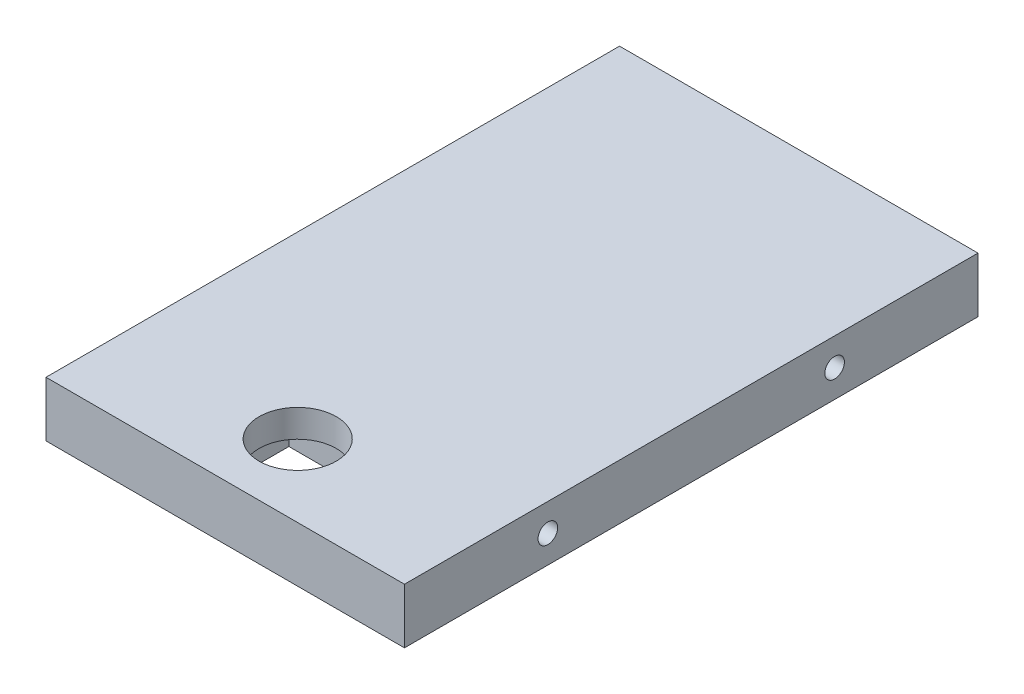
ISO-10303-21;
HEADER;
FILE_DESCRIPTION(('STEP AP214'),'2;1');
FILE_NAME('part.step','',(''),(''),'','','');
FILE_SCHEMA(('AUTOMOTIVE_DESIGN { 1 0 10303 214 1 1 1 1 }'));
ENDSEC;
DATA;
#1=APPLICATION_CONTEXT('core data for automotive mechanical design processes');
#2=APPLICATION_PROTOCOL_DEFINITION('international standard','automotive_design',2000,#1);
#3=PRODUCT_CONTEXT('',#1,'mechanical');
#4=PRODUCT('Part','Part','',(#3));
#5=PRODUCT_RELATED_PRODUCT_CATEGORY('part','',(#4));
#6=PRODUCT_DEFINITION_FORMATION('','',#4);
#7=PRODUCT_DEFINITION_CONTEXT('part definition',#1,'design');
#8=PRODUCT_DEFINITION('design','',#6,#7);
#9=PRODUCT_DEFINITION_SHAPE('','',#8);
#10=(LENGTH_UNIT() NAMED_UNIT(*) SI_UNIT(.MILLI.,.METRE.));
#11=(NAMED_UNIT(*) PLANE_ANGLE_UNIT() SI_UNIT($,.RADIAN.));
#12=(NAMED_UNIT(*) SI_UNIT($,.STERADIAN.) SOLID_ANGLE_UNIT());
#13=UNCERTAINTY_MEASURE_WITH_UNIT(LENGTH_MEASURE(1.E-05),#10,'distance_accuracy_value','');
#14=(GEOMETRIC_REPRESENTATION_CONTEXT(3) GLOBAL_UNCERTAINTY_ASSIGNED_CONTEXT((#13)) GLOBAL_UNIT_ASSIGNED_CONTEXT((#10,
#11,#12)) REPRESENTATION_CONTEXT('',''));
#15=CARTESIAN_POINT('',(0.,0.,0.));
#16=DIRECTION('',(0.,0.,1.));
#17=DIRECTION('',(1.,0.,0.));
#18=AXIS2_PLACEMENT_3D('',#15,#16,#17);
#19=CARTESIAN_POINT('',(0.,5.,0.));
#20=DIRECTION('',(1.,0.,0.));
#21=DIRECTION('',(0.,0.,-1.));
#22=AXIS2_PLACEMENT_3D('',#19,#20,#21);
#23=PLANE('',#22);
#24=CARTESIAN_POINT('',(0.,2.5,-39.));
#25=DIRECTION('',(-1.,0.,0.));
#26=DIRECTION('',(0.,0.,1.));
#27=AXIS2_PLACEMENT_3D('',#24,#25,#26);
#28=CIRCLE('',#27,0.889);
#29=CARTESIAN_POINT('',(0.,2.5,-38.111));
#30=VERTEX_POINT('',#29);
#31=EDGE_CURVE('E201',#30,#30,#28,.T.);
#32=ORIENTED_EDGE('',*,*,#31,.F.);
#33=EDGE_LOOP('',(#32));
#34=FACE_BOUND('',#33,.T.);
#35=CARTESIAN_POINT('',(0.,2.5,-13.));
#36=DIRECTION('',(-1.,0.,0.));
#37=DIRECTION('',(0.,0.,1.));
#38=AXIS2_PLACEMENT_3D('',#35,#36,#37);
#39=CIRCLE('',#38,0.889);
#40=CARTESIAN_POINT('',(0.,2.5,-12.111));
#41=VERTEX_POINT('',#40);
#42=EDGE_CURVE('E209',#41,#41,#39,.T.);
#43=ORIENTED_EDGE('',*,*,#42,.F.);
#44=EDGE_LOOP('',(#43));
#45=FACE_BOUND('',#44,.T.);
#46=DIRECTION('',(0.,0.,1.));
#47=VECTOR('',#46,1.);
#48=CARTESIAN_POINT('',(0.,0.,0.));
#49=LINE('',#48,#47);
#50=CARTESIAN_POINT('',(0.,0.,-52.));
#51=VERTEX_POINT('',#50);
#52=CARTESIAN_POINT('',(0.,0.,0.));
#53=VERTEX_POINT('',#52);
#54=EDGE_CURVE('E217',#51,#53,#49,.T.);
#55=ORIENTED_EDGE('',*,*,#54,.T.);
#56=DIRECTION('',(0.,-1.,0.));
#57=VECTOR('',#56,1.);
#58=CARTESIAN_POINT('',(0.,5.,0.));
#59=LINE('',#58,#57);
#60=CARTESIAN_POINT('',(0.,5.,0.));
#61=VERTEX_POINT('',#60);
#62=EDGE_CURVE('E11',#61,#53,#59,.T.);
#63=ORIENTED_EDGE('',*,*,#62,.F.);
#64=DIRECTION('',(0.,0.,1.));
#65=VECTOR('',#64,1.);
#66=CARTESIAN_POINT('',(0.,5.,0.));
#67=LINE('',#66,#65);
#68=CARTESIAN_POINT('',(0.,5.,-52.));
#69=VERTEX_POINT('',#68);
#70=EDGE_CURVE('E218',#69,#61,#67,.T.);
#71=ORIENTED_EDGE('',*,*,#70,.F.);
#72=DIRECTION('',(0.,-1.,0.));
#73=VECTOR('',#72,1.);
#74=CARTESIAN_POINT('',(0.,5.,-52.));
#75=LINE('',#74,#73);
#76=EDGE_CURVE('E228',#69,#51,#75,.T.);
#77=ORIENTED_EDGE('',*,*,#76,.T.);
#78=EDGE_LOOP('',(#55,#63,#71,#77));
#79=FACE_BOUND('',#78,.T.);
#80=ADVANCED_FACE('F45',(#34,#45,#79),#23,.F.);
#81=CARTESIAN_POINT('',(0.,5.,0.));
#82=DIRECTION('',(0.,0.,-1.));
#83=DIRECTION('',(-1.,0.,0.));
#84=AXIS2_PLACEMENT_3D('',#81,#82,#83);
#85=PLANE('',#84);
#86=DIRECTION('',(1.,0.,0.));
#87=VECTOR('',#86,1.);
#88=CARTESIAN_POINT('',(0.,0.,0.));
#89=LINE('',#88,#87);
#90=CARTESIAN_POINT('',(32.5,0.,0.));
#91=VERTEX_POINT('',#90);
#92=EDGE_CURVE('E232',#53,#91,#89,.T.);
#93=ORIENTED_EDGE('',*,*,#92,.T.);
#94=DIRECTION('',(0.,-1.,0.));
#95=VECTOR('',#94,1.);
#96=CARTESIAN_POINT('',(32.5,5.,0.));
#97=LINE('',#96,#95);
#98=CARTESIAN_POINT('',(32.5,5.,0.));
#99=VERTEX_POINT('',#98);
#100=EDGE_CURVE('E53',#99,#91,#97,.T.);
#101=ORIENTED_EDGE('',*,*,#100,.F.);
#102=DIRECTION('',(1.,0.,0.));
#103=VECTOR('',#102,1.);
#104=CARTESIAN_POINT('',(0.,5.,0.));
#105=LINE('',#104,#103);
#106=EDGE_CURVE('E97',#61,#99,#105,.T.);
#107=ORIENTED_EDGE('',*,*,#106,.F.);
#108=ORIENTED_EDGE('',*,*,#62,.T.);
#109=EDGE_LOOP('',(#93,#101,#107,#108));
#110=FACE_BOUND('',#109,.T.);
#111=ADVANCED_FACE('F267',(#110),#85,.F.);
#112=CARTESIAN_POINT('',(32.5,5.,0.));
#113=DIRECTION('',(-1.,0.,0.));
#114=DIRECTION('',(0.,0.,1.));
#115=AXIS2_PLACEMENT_3D('',#112,#113,#114);
#116=PLANE('',#115);
#117=CARTESIAN_POINT('',(32.5,2.5,-13.));
#118=DIRECTION('',(1.,0.,0.));
#119=DIRECTION('',(0.,0.,-1.));
#120=AXIS2_PLACEMENT_3D('',#117,#118,#119);
#121=CIRCLE('',#120,0.888999999999989);
#122=CARTESIAN_POINT('',(32.5,2.5,-13.889));
#123=VERTEX_POINT('',#122);
#124=EDGE_CURVE('E180',#123,#123,#121,.T.);
#125=ORIENTED_EDGE('',*,*,#124,.F.);
#126=EDGE_LOOP('',(#125));
#127=FACE_BOUND('',#126,.T.);
#128=CARTESIAN_POINT('',(32.5,2.5,-39.));
#129=DIRECTION('',(1.,0.,0.));
#130=DIRECTION('',(0.,0.,-1.));
#131=AXIS2_PLACEMENT_3D('',#128,#129,#130);
#132=CIRCLE('',#131,0.888999999999989);
#133=CARTESIAN_POINT('',(32.5,2.5,-39.889));
#134=VERTEX_POINT('',#133);
#135=EDGE_CURVE('E193',#134,#134,#132,.T.);
#136=ORIENTED_EDGE('',*,*,#135,.F.);
#137=EDGE_LOOP('',(#136));
#138=FACE_BOUND('',#137,.T.);
#139=DIRECTION('',(0.,0.,-1.));
#140=VECTOR('',#139,1.);
#141=CARTESIAN_POINT('',(32.5,0.,0.));
#142=LINE('',#141,#140);
#143=CARTESIAN_POINT('',(32.5,0.,-52.));
#144=VERTEX_POINT('',#143);
#145=EDGE_CURVE('E235',#91,#144,#142,.T.);
#146=ORIENTED_EDGE('',*,*,#145,.T.);
#147=DIRECTION('',(0.,-1.,0.));
#148=VECTOR('',#147,1.);
#149=CARTESIAN_POINT('',(32.5,5.,-52.));
#150=LINE('',#149,#148);
#151=CARTESIAN_POINT('',(32.5,5.,-52.));
#152=VERTEX_POINT('',#151);
#153=EDGE_CURVE('E242',#152,#144,#150,.T.);
#154=ORIENTED_EDGE('',*,*,#153,.F.);
#155=DIRECTION('',(0.,0.,-1.));
#156=VECTOR('',#155,1.);
#157=CARTESIAN_POINT('',(32.5,5.,0.));
#158=LINE('',#157,#156);
#159=EDGE_CURVE('E223',#99,#152,#158,.T.);
#160=ORIENTED_EDGE('',*,*,#159,.F.);
#161=ORIENTED_EDGE('',*,*,#100,.T.);
#162=EDGE_LOOP('',(#146,#154,#160,#161));
#163=FACE_BOUND('',#162,.T.);
#164=ADVANCED_FACE('F249',(#127,#138,#163),#116,.F.);
#165=CARTESIAN_POINT('',(0.,5.,-52.));
#166=DIRECTION('',(0.,0.,1.));
#167=DIRECTION('',(1.,0.,0.));
#168=AXIS2_PLACEMENT_3D('',#165,#166,#167);
#169=PLANE('',#168);
#170=DIRECTION('',(-1.,0.,0.));
#171=VECTOR('',#170,1.);
#172=CARTESIAN_POINT('',(0.,0.,-52.));
#173=LINE('',#172,#171);
#174=EDGE_CURVE('E90',#144,#51,#173,.T.);
#175=ORIENTED_EDGE('',*,*,#174,.T.);
#176=ORIENTED_EDGE('',*,*,#76,.F.);
#177=DIRECTION('',(-1.,0.,0.));
#178=VECTOR('',#177,1.);
#179=CARTESIAN_POINT('',(0.,5.,-52.));
#180=LINE('',#179,#178);
#181=EDGE_CURVE('E69',#152,#69,#180,.T.);
#182=ORIENTED_EDGE('',*,*,#181,.F.);
#183=ORIENTED_EDGE('',*,*,#153,.T.);
#184=EDGE_LOOP('',(#175,#176,#182,#183));
#185=FACE_BOUND('',#184,.T.);
#186=ADVANCED_FACE('F257',(#185),#169,.F.);
#187=CARTESIAN_POINT('',(0.,5.,0.));
#188=DIRECTION('',(0.,-1.,0.));
#189=DIRECTION('',(0.,0.,-1.));
#190=AXIS2_PLACEMENT_3D('',#187,#188,#189);
#191=PLANE('',#190);
#192=CARTESIAN_POINT('',(16.25,5.,-6.57));
#193=DIRECTION('',(0.,1.,0.));
#194=DIRECTION('',(0.,0.,1.));
#195=AXIS2_PLACEMENT_3D('',#192,#193,#194);
#196=CIRCLE('',#195,3.5);
#197=CARTESIAN_POINT('',(16.25,5.,-3.07));
#198=VERTEX_POINT('',#197);
#199=EDGE_CURVE('E159',#198,#198,#196,.T.);
#200=ORIENTED_EDGE('',*,*,#199,.F.);
#201=EDGE_LOOP('',(#200));
#202=FACE_BOUND('',#201,.T.);
#203=ORIENTED_EDGE('',*,*,#70,.T.);
#204=ORIENTED_EDGE('',*,*,#106,.T.);
#205=ORIENTED_EDGE('',*,*,#159,.T.);
#206=ORIENTED_EDGE('',*,*,#181,.T.);
#207=EDGE_LOOP('',(#203,#204,#205,#206));
#208=FACE_BOUND('',#207,.T.);
#209=ADVANCED_FACE('F259',(#202,#208),#191,.F.);
#210=CARTESIAN_POINT('',(0.,0.,0.));
#211=DIRECTION('',(0.,-1.,0.));
#212=DIRECTION('',(0.,0.,-1.));
#213=AXIS2_PLACEMENT_3D('',#210,#211,#212);
#214=PLANE('',#213);
#215=DIRECTION('',(0.,0.,1.));
#216=VECTOR('',#215,1.);
#217=CARTESIAN_POINT('',(21.05,0.,-6.57));
#218=LINE('',#217,#216);
#219=CARTESIAN_POINT('',(21.05,0.,-10.57));
#220=VERTEX_POINT('',#219);
#221=CARTESIAN_POINT('',(21.05,0.,-2.57));
#222=VERTEX_POINT('',#221);
#223=EDGE_CURVE('E135',#220,#222,#218,.T.);
#224=ORIENTED_EDGE('',*,*,#223,.F.);
#225=DIRECTION('',(1.,0.,0.));
#226=VECTOR('',#225,1.);
#227=CARTESIAN_POINT('',(21.05,0.,-10.57));
#228=LINE('',#227,#226);
#229=CARTESIAN_POINT('',(11.45,0.,-10.57));
#230=VERTEX_POINT('',#229);
#231=EDGE_CURVE('E156',#230,#220,#228,.T.);
#232=ORIENTED_EDGE('',*,*,#231,.F.);
#233=DIRECTION('',(0.,0.,-1.));
#234=VECTOR('',#233,1.);
#235=CARTESIAN_POINT('',(11.45,0.,-10.57));
#236=LINE('',#235,#234);
#237=CARTESIAN_POINT('',(11.45,0.,-2.57));
#238=VERTEX_POINT('',#237);
#239=EDGE_CURVE('E169',#238,#230,#236,.T.);
#240=ORIENTED_EDGE('',*,*,#239,.F.);
#241=DIRECTION('',(-1.,0.,0.));
#242=VECTOR('',#241,1.);
#243=CARTESIAN_POINT('',(11.45,0.,-2.57));
#244=LINE('',#243,#242);
#245=EDGE_CURVE('E166',#222,#238,#244,.T.);
#246=ORIENTED_EDGE('',*,*,#245,.F.);
#247=EDGE_LOOP('',(#224,#232,#240,#246));
#248=FACE_BOUND('',#247,.T.);
#249=ORIENTED_EDGE('',*,*,#54,.F.);
#250=ORIENTED_EDGE('',*,*,#174,.F.);
#251=ORIENTED_EDGE('',*,*,#145,.F.);
#252=ORIENTED_EDGE('',*,*,#92,.F.);
#253=EDGE_LOOP('',(#249,#250,#251,#252));
#254=FACE_BOUND('',#253,.T.);
#255=ADVANCED_FACE('F253',(#248,#254),#214,.T.);
#256=CARTESIAN_POINT('',(7.4658349096845,2.5,-13.));
#257=DIRECTION('',(-1.,0.,0.));
#258=DIRECTION('',(0.,0.,1.));
#259=AXIS2_PLACEMENT_3D('',#256,#257,#258);
#260=CONICAL_SURFACE('',#259,0.888999999999998,1.02974425867665);
#261=CARTESIAN_POINT('',(8.,2.5,-13.));
#262=VERTEX_POINT('',#261);
#263=VERTEX_LOOP('',#262);
#264=FACE_BOUND('',#263,.T.);
#265=CARTESIAN_POINT('',(7.4658349096845,2.5,-13.));
#266=DIRECTION('',(-1.,0.,0.));
#267=DIRECTION('',(0.,0.,1.));
#268=AXIS2_PLACEMENT_3D('',#265,#266,#267);
#269=CIRCLE('',#268,0.888999999999998);
#270=CARTESIAN_POINT('',(7.4658349096845,2.5,-12.111));
#271=VERTEX_POINT('',#270);
#272=EDGE_CURVE('E213',#271,#271,#269,.T.);
#273=ORIENTED_EDGE('',*,*,#272,.T.);
#274=EDGE_LOOP('',(#273));
#275=FACE_BOUND('',#274,.T.);
#276=ADVANCED_FACE('F283',(#264,#275),#260,.F.);
#277=CARTESIAN_POINT('',(0.,2.5,-13.));
#278=DIRECTION('',(-1.,0.,0.));
#279=DIRECTION('',(0.,0.,1.));
#280=AXIS2_PLACEMENT_3D('',#277,#278,#279);
#281=CYLINDRICAL_SURFACE('',#280,0.888999999999999);
#282=ORIENTED_EDGE('',*,*,#272,.F.);
#283=EDGE_LOOP('',(#282));
#284=FACE_BOUND('',#283,.T.);
#285=ORIENTED_EDGE('',*,*,#42,.T.);
#286=EDGE_LOOP('',(#285));
#287=FACE_BOUND('',#286,.T.);
#288=ADVANCED_FACE('F280',(#284,#287),#281,.F.);
#289=CARTESIAN_POINT('',(7.4658349096845,2.5,-39.));
#290=DIRECTION('',(-1.,0.,0.));
#291=DIRECTION('',(0.,0.,1.));
#292=AXIS2_PLACEMENT_3D('',#289,#290,#291);
#293=CONICAL_SURFACE('',#292,0.888999999999998,1.02974425867665);
#294=CARTESIAN_POINT('',(8.,2.5,-39.));
#295=VERTEX_POINT('',#294);
#296=VERTEX_LOOP('',#295);
#297=FACE_BOUND('',#296,.T.);
#298=CARTESIAN_POINT('',(7.4658349096845,2.5,-39.));
#299=DIRECTION('',(-1.,0.,0.));
#300=DIRECTION('',(0.,0.,1.));
#301=AXIS2_PLACEMENT_3D('',#298,#299,#300);
#302=CIRCLE('',#301,0.888999999999998);
#303=CARTESIAN_POINT('',(7.4658349096845,2.5,-38.111));
#304=VERTEX_POINT('',#303);
#305=EDGE_CURVE('E205',#304,#304,#302,.T.);
#306=ORIENTED_EDGE('',*,*,#305,.T.);
#307=EDGE_LOOP('',(#306));
#308=FACE_BOUND('',#307,.T.);
#309=ADVANCED_FACE('F282',(#297,#308),#293,.F.);
#310=CARTESIAN_POINT('',(0.,2.5,-39.));
#311=DIRECTION('',(-1.,0.,0.));
#312=DIRECTION('',(0.,0.,1.));
#313=AXIS2_PLACEMENT_3D('',#310,#311,#312);
#314=CYLINDRICAL_SURFACE('',#313,0.888999999999999);
#315=ORIENTED_EDGE('',*,*,#305,.F.);
#316=EDGE_LOOP('',(#315));
#317=FACE_BOUND('',#316,.T.);
#318=ORIENTED_EDGE('',*,*,#31,.T.);
#319=EDGE_LOOP('',(#318));
#320=FACE_BOUND('',#319,.T.);
#321=ADVANCED_FACE('F290',(#317,#320),#314,.F.);
#322=CARTESIAN_POINT('',(25.0341650903155,2.5,-39.));
#323=DIRECTION('',(1.,0.,0.));
#324=DIRECTION('',(0.,0.,-1.));
#325=AXIS2_PLACEMENT_3D('',#322,#323,#324);
#326=CONICAL_SURFACE('',#325,0.888999999999998,1.02974425867665);
#327=CARTESIAN_POINT('',(24.5,2.5,-39.));
#328=VERTEX_POINT('',#327);
#329=VERTEX_LOOP('',#328);
#330=FACE_BOUND('',#329,.T.);
#331=CARTESIAN_POINT('',(25.0341650903155,2.5,-39.));
#332=DIRECTION('',(1.,0.,0.));
#333=DIRECTION('',(0.,0.,-1.));
#334=AXIS2_PLACEMENT_3D('',#331,#332,#333);
#335=CIRCLE('',#334,0.888999999999998);
#336=CARTESIAN_POINT('',(25.0341650903155,2.5,-39.889));
#337=VERTEX_POINT('',#336);
#338=EDGE_CURVE('E197',#337,#337,#335,.T.);
#339=ORIENTED_EDGE('',*,*,#338,.T.);
#340=EDGE_LOOP('',(#339));
#341=FACE_BOUND('',#340,.T.);
#342=ADVANCED_FACE('F330',(#330,#341),#326,.F.);
#343=CARTESIAN_POINT('',(32.5,2.5,-39.));
#344=DIRECTION('',(1.,0.,0.));
#345=DIRECTION('',(0.,0.,-1.));
#346=AXIS2_PLACEMENT_3D('',#343,#344,#345);
#347=CYLINDRICAL_SURFACE('',#346,0.888999999999993);
#348=ORIENTED_EDGE('',*,*,#338,.F.);
#349=EDGE_LOOP('',(#348));
#350=FACE_BOUND('',#349,.T.);
#351=ORIENTED_EDGE('',*,*,#135,.T.);
#352=EDGE_LOOP('',(#351));
#353=FACE_BOUND('',#352,.T.);
#354=ADVANCED_FACE('F326',(#350,#353),#347,.F.);
#355=CARTESIAN_POINT('',(25.0341650903155,2.5,-13.));
#356=DIRECTION('',(1.,0.,0.));
#357=DIRECTION('',(0.,0.,-1.));
#358=AXIS2_PLACEMENT_3D('',#355,#356,#357);
#359=CONICAL_SURFACE('',#358,0.888999999999998,1.02974425867665);
#360=CARTESIAN_POINT('',(24.5,2.5,-13.));
#361=VERTEX_POINT('',#360);
#362=VERTEX_LOOP('',#361);
#363=FACE_BOUND('',#362,.T.);
#364=CARTESIAN_POINT('',(25.0341650903155,2.5,-13.));
#365=DIRECTION('',(1.,0.,0.));
#366=DIRECTION('',(0.,0.,-1.));
#367=AXIS2_PLACEMENT_3D('',#364,#365,#366);
#368=CIRCLE('',#367,0.888999999999998);
#369=CARTESIAN_POINT('',(25.0341650903155,2.5,-13.889));
#370=VERTEX_POINT('',#369);
#371=EDGE_CURVE('E189',#370,#370,#368,.T.);
#372=ORIENTED_EDGE('',*,*,#371,.T.);
#373=EDGE_LOOP('',(#372));
#374=FACE_BOUND('',#373,.T.);
#375=ADVANCED_FACE('F322',(#363,#374),#359,.F.);
#376=CARTESIAN_POINT('',(32.5,2.5,-13.));
#377=DIRECTION('',(1.,0.,0.));
#378=DIRECTION('',(0.,0.,-1.));
#379=AXIS2_PLACEMENT_3D('',#376,#377,#378);
#380=CYLINDRICAL_SURFACE('',#379,0.888999999999994);
#381=ORIENTED_EDGE('',*,*,#371,.F.);
#382=EDGE_LOOP('',(#381));
#383=FACE_BOUND('',#382,.T.);
#384=ORIENTED_EDGE('',*,*,#124,.T.);
#385=EDGE_LOOP('',(#384));
#386=FACE_BOUND('',#385,.T.);
#387=ADVANCED_FACE('F314',(#383,#386),#380,.F.);
#388=CARTESIAN_POINT('',(21.05,2.5,-6.57));
#389=DIRECTION('',(1.,0.,0.));
#390=DIRECTION('',(0.,0.,-1.));
#391=AXIS2_PLACEMENT_3D('',#388,#389,#390);
#392=PLANE('',#391);
#393=ORIENTED_EDGE('',*,*,#223,.T.);
#394=DIRECTION('',(0.,-1.,0.));
#395=VECTOR('',#394,1.);
#396=CARTESIAN_POINT('',(21.05,2.5,-2.57));
#397=LINE('',#396,#395);
#398=CARTESIAN_POINT('',(21.05,2.5,-2.57));
#399=VERTEX_POINT('',#398);
#400=EDGE_CURVE('E60',#399,#222,#397,.T.);
#401=ORIENTED_EDGE('',*,*,#400,.F.);
#402=DIRECTION('',(0.,0.,1.));
#403=VECTOR('',#402,1.);
#404=CARTESIAN_POINT('',(21.05,2.5,-2.57));
#405=LINE('',#404,#403);
#406=CARTESIAN_POINT('',(21.05,2.5,-10.57));
#407=VERTEX_POINT('',#406);
#408=EDGE_CURVE('E132',#407,#399,#405,.T.);
#409=ORIENTED_EDGE('',*,*,#408,.F.);
#410=DIRECTION('',(0.,-1.,0.));
#411=VECTOR('',#410,1.);
#412=CARTESIAN_POINT('',(21.05,2.5,-10.57));
#413=LINE('',#412,#411);
#414=EDGE_CURVE('E177',#407,#220,#413,.T.);
#415=ORIENTED_EDGE('',*,*,#414,.T.);
#416=EDGE_LOOP('',(#393,#401,#409,#415));
#417=FACE_BOUND('',#416,.T.);
#418=ADVANCED_FACE('F130',(#417),#392,.F.);
#419=CARTESIAN_POINT('',(21.05,2.5,-10.57));
#420=DIRECTION('',(0.,0.,-1.));
#421=DIRECTION('',(-1.,0.,0.));
#422=AXIS2_PLACEMENT_3D('',#419,#420,#421);
#423=PLANE('',#422);
#424=ORIENTED_EDGE('',*,*,#231,.T.);
#425=ORIENTED_EDGE('',*,*,#414,.F.);
#426=DIRECTION('',(1.,0.,0.));
#427=VECTOR('',#426,1.);
#428=CARTESIAN_POINT('',(21.05,2.5,-10.57));
#429=LINE('',#428,#427);
#430=CARTESIAN_POINT('',(11.45,2.5,-10.57));
#431=VERTEX_POINT('',#430);
#432=EDGE_CURVE('E139',#431,#407,#429,.T.);
#433=ORIENTED_EDGE('',*,*,#432,.F.);
#434=DIRECTION('',(0.,-1.,0.));
#435=VECTOR('',#434,1.);
#436=CARTESIAN_POINT('',(11.45,2.5,-10.57));
#437=LINE('',#436,#435);
#438=EDGE_CURVE('E181',#431,#230,#437,.T.);
#439=ORIENTED_EDGE('',*,*,#438,.T.);
#440=EDGE_LOOP('',(#424,#425,#433,#439));
#441=FACE_BOUND('',#440,.T.);
#442=ADVANCED_FACE('F306',(#441),#423,.F.);
#443=CARTESIAN_POINT('',(11.45,2.5,-10.57));
#444=DIRECTION('',(-1.,0.,0.));
#445=DIRECTION('',(0.,0.,1.));
#446=AXIS2_PLACEMENT_3D('',#443,#444,#445);
#447=PLANE('',#446);
#448=ORIENTED_EDGE('',*,*,#239,.T.);
#449=ORIENTED_EDGE('',*,*,#438,.F.);
#450=DIRECTION('',(0.,0.,-1.));
#451=VECTOR('',#450,1.);
#452=CARTESIAN_POINT('',(11.45,2.5,-10.57));
#453=LINE('',#452,#451);
#454=CARTESIAN_POINT('',(11.45,2.5,-2.57));
#455=VERTEX_POINT('',#454);
#456=EDGE_CURVE('E148',#455,#431,#453,.T.);
#457=ORIENTED_EDGE('',*,*,#456,.F.);
#458=DIRECTION('',(0.,-1.,0.));
#459=VECTOR('',#458,1.);
#460=CARTESIAN_POINT('',(11.45,2.5,-2.57));
#461=LINE('',#460,#459);
#462=EDGE_CURVE('E138',#455,#238,#461,.T.);
#463=ORIENTED_EDGE('',*,*,#462,.T.);
#464=EDGE_LOOP('',(#448,#449,#457,#463));
#465=FACE_BOUND('',#464,.T.);
#466=ADVANCED_FACE('F304',(#465),#447,.F.);
#467=CARTESIAN_POINT('',(11.45,2.5,-2.57));
#468=DIRECTION('',(0.,0.,1.));
#469=DIRECTION('',(1.,0.,0.));
#470=AXIS2_PLACEMENT_3D('',#467,#468,#469);
#471=PLANE('',#470);
#472=ORIENTED_EDGE('',*,*,#245,.T.);
#473=ORIENTED_EDGE('',*,*,#462,.F.);
#474=DIRECTION('',(-1.,0.,0.));
#475=VECTOR('',#474,1.);
#476=CARTESIAN_POINT('',(11.45,2.5,-2.57));
#477=LINE('',#476,#475);
#478=EDGE_CURVE('E142',#399,#455,#477,.T.);
#479=ORIENTED_EDGE('',*,*,#478,.F.);
#480=ORIENTED_EDGE('',*,*,#400,.T.);
#481=EDGE_LOOP('',(#472,#473,#479,#480));
#482=FACE_BOUND('',#481,.T.);
#483=ADVANCED_FACE('F143',(#482),#471,.F.);
#484=CARTESIAN_POINT('',(0.,2.5,0.));
#485=DIRECTION('',(0.,1.,0.));
#486=DIRECTION('',(0.,0.,1.));
#487=AXIS2_PLACEMENT_3D('',#484,#485,#486);
#488=PLANE('',#487);
#489=CARTESIAN_POINT('',(16.25,2.5,-6.57));
#490=DIRECTION('',(0.,1.,0.));
#491=DIRECTION('',(0.,0.,1.));
#492=AXIS2_PLACEMENT_3D('',#489,#490,#491);
#493=CIRCLE('',#492,3.5);
#494=CARTESIAN_POINT('',(16.25,2.5,-3.07));
#495=VERTEX_POINT('',#494);
#496=EDGE_CURVE('E170',#495,#495,#493,.T.);
#497=ORIENTED_EDGE('',*,*,#496,.T.);
#498=EDGE_LOOP('',(#497));
#499=FACE_BOUND('',#498,.T.);
#500=ORIENTED_EDGE('',*,*,#408,.T.);
#501=ORIENTED_EDGE('',*,*,#478,.T.);
#502=ORIENTED_EDGE('',*,*,#456,.T.);
#503=ORIENTED_EDGE('',*,*,#432,.T.);
#504=EDGE_LOOP('',(#500,#501,#502,#503));
#505=FACE_BOUND('',#504,.T.);
#506=ADVANCED_FACE('F151',(#499,#505),#488,.F.);
#507=CARTESIAN_POINT('',(16.25,2.5,-6.57));
#508=DIRECTION('',(0.,1.,0.));
#509=DIRECTION('',(0.,0.,1.));
#510=AXIS2_PLACEMENT_3D('',#507,#508,#509);
#511=CYLINDRICAL_SURFACE('',#510,3.5);
#512=ORIENTED_EDGE('',*,*,#496,.F.);
#513=EDGE_LOOP('',(#512));
#514=FACE_BOUND('',#513,.T.);
#515=ORIENTED_EDGE('',*,*,#199,.T.);
#516=EDGE_LOOP('',(#515));
#517=FACE_BOUND('',#516,.T.);
#518=ADVANCED_FACE('F402',(#514,#517),#511,.F.);
#519=CLOSED_SHELL('',(#80,#111,#164,#186,#209,#255,#276,#288,#309,#321,#342,#354,#375,#387,#418,
#442,#466,#483,#506,#518));
#520=MANIFOLD_SOLID_BREP('B2',#519);
#521=ADVANCED_BREP_SHAPE_REPRESENTATION('',(#18,#520),#14);
#522=SHAPE_DEFINITION_REPRESENTATION(#9,#521);
ENDSEC;
END-ISO-10303-21;
